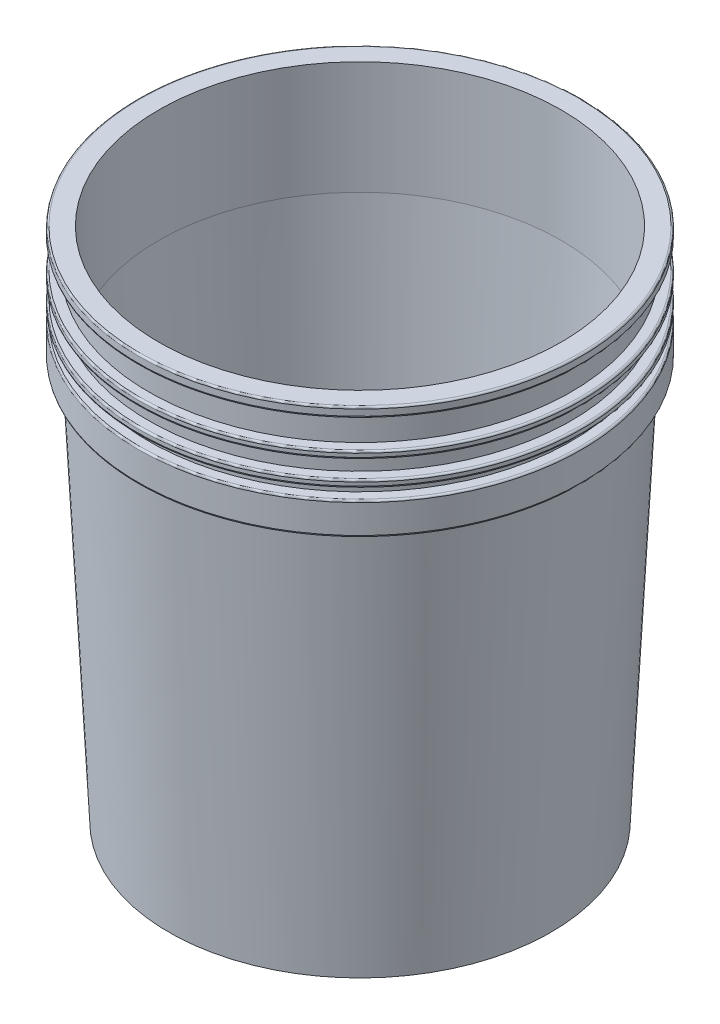
ISO-10303-21;
HEADER;
FILE_DESCRIPTION(('STEP AP214'),'2;1');
FILE_NAME('part.step','',(''),(''),'','','');
FILE_SCHEMA(('AUTOMOTIVE_DESIGN { 1 0 10303 214 1 1 1 1 }'));
ENDSEC;
DATA;
#1=APPLICATION_CONTEXT('core data for automotive mechanical design processes');
#2=APPLICATION_PROTOCOL_DEFINITION('international standard','automotive_design',2000,#1);
#3=PRODUCT_CONTEXT('',#1,'mechanical');
#4=PRODUCT('Part','Part','',(#3));
#5=PRODUCT_RELATED_PRODUCT_CATEGORY('part','',(#4));
#6=PRODUCT_DEFINITION_FORMATION('','',#4);
#7=PRODUCT_DEFINITION_CONTEXT('part definition',#1,'design');
#8=PRODUCT_DEFINITION('design','',#6,#7);
#9=PRODUCT_DEFINITION_SHAPE('','',#8);
#10=(LENGTH_UNIT() NAMED_UNIT(*) SI_UNIT(.MILLI.,.METRE.));
#11=(NAMED_UNIT(*) PLANE_ANGLE_UNIT() SI_UNIT($,.RADIAN.));
#12=(NAMED_UNIT(*) SI_UNIT($,.STERADIAN.) SOLID_ANGLE_UNIT());
#13=UNCERTAINTY_MEASURE_WITH_UNIT(LENGTH_MEASURE(1.E-05),#10,'distance_accuracy_value','');
#14=(GEOMETRIC_REPRESENTATION_CONTEXT(3) GLOBAL_UNCERTAINTY_ASSIGNED_CONTEXT((#13)) GLOBAL_UNIT_ASSIGNED_CONTEXT((#10,
#11,#12)) REPRESENTATION_CONTEXT('',''));
#15=CARTESIAN_POINT('',(0.,0.,0.));
#16=DIRECTION('',(0.,0.,1.));
#17=DIRECTION('',(1.,0.,0.));
#18=AXIS2_PLACEMENT_3D('',#15,#16,#17);
#19=CARTESIAN_POINT('',(0.,6.35,0.));
#20=DIRECTION('',(0.,-1.,0.));
#21=DIRECTION('',(0.,0.,-1.));
#22=AXIS2_PLACEMENT_3D('',#19,#20,#21);
#23=PLANE('',#22);
#24=CARTESIAN_POINT('',(0.,6.35,0.));
#25=DIRECTION('',(0.,-1.,0.));
#26=DIRECTION('',(0.,0.,-1.));
#27=AXIS2_PLACEMENT_3D('',#24,#25,#26);
#28=CIRCLE('',#27,25.4);
#29=CARTESIAN_POINT('',(0.,6.35,-25.4));
#30=VERTEX_POINT('',#29);
#31=EDGE_CURVE('E109',#30,#30,#28,.T.);
#32=ORIENTED_EDGE('',*,*,#31,.T.);
#33=EDGE_LOOP('',(#32));
#34=FACE_BOUND('',#33,.T.);
#35=ADVANCED_FACE('F37',(#34),#23,.T.);
#36=CARTESIAN_POINT('',(0.,0.,0.));
#37=DIRECTION('',(0.,-1.,0.));
#38=DIRECTION('',(0.,0.,-1.));
#39=AXIS2_PLACEMENT_3D('',#36,#37,#38);
#40=CYLINDRICAL_SURFACE('',#39,25.4);
#41=CARTESIAN_POINT('',(0.,0.,0.));
#42=DIRECTION('',(0.,-1.,0.));
#43=DIRECTION('',(0.,0.,-1.));
#44=AXIS2_PLACEMENT_3D('',#41,#42,#43);
#45=CIRCLE('',#44,25.4);
#46=CARTESIAN_POINT('',(0.,0.,-25.4));
#47=VERTEX_POINT('',#46);
#48=EDGE_CURVE('E113',#47,#47,#45,.T.);
#49=ORIENTED_EDGE('',*,*,#48,.T.);
#50=EDGE_LOOP('',(#49));
#51=FACE_BOUND('',#50,.T.);
#52=ORIENTED_EDGE('',*,*,#31,.F.);
#53=EDGE_LOOP('',(#52));
#54=FACE_BOUND('',#53,.T.);
#55=ADVANCED_FACE('F195',(#51,#54),#40,.F.);
#56=CARTESIAN_POINT('',(25.4,0.,0.));
#57=DIRECTION('',(0.,-1.,0.));
#58=DIRECTION('',(0.,0.,-1.));
#59=AXIS2_PLACEMENT_3D('',#56,#57,#58);
#60=PLANE('',#59);
#61=CARTESIAN_POINT('',(0.,0.,0.));
#62=DIRECTION('',(0.,-1.,0.));
#63=DIRECTION('',(0.,0.,-1.));
#64=AXIS2_PLACEMENT_3D('',#61,#62,#63);
#65=CIRCLE('',#64,32.4);
#66=CARTESIAN_POINT('',(0.,0.,-32.4));
#67=VERTEX_POINT('',#66);
#68=EDGE_CURVE('E117',#67,#67,#65,.T.);
#69=ORIENTED_EDGE('',*,*,#68,.T.);
#70=EDGE_LOOP('',(#69));
#71=FACE_BOUND('',#70,.T.);
#72=ORIENTED_EDGE('',*,*,#48,.F.);
#73=EDGE_LOOP('',(#72));
#74=FACE_BOUND('',#73,.T.);
#75=ADVANCED_FACE('F201',(#71,#74),#60,.T.);
#76=CARTESIAN_POINT('',(0.,0.,0.));
#77=DIRECTION('',(0.,-1.,0.));
#78=DIRECTION('',(0.,0.,-1.));
#79=AXIS2_PLACEMENT_3D('',#76,#77,#78);
#80=CYLINDRICAL_SURFACE('',#79,32.4);
#81=CARTESIAN_POINT('',(0.,6.35,0.));
#82=DIRECTION('',(0.,-1.,0.));
#83=DIRECTION('',(0.,0.,-1.));
#84=AXIS2_PLACEMENT_3D('',#81,#82,#83);
#85=CIRCLE('',#84,32.4);
#86=CARTESIAN_POINT('',(0.,6.35,-32.4));
#87=VERTEX_POINT('',#86);
#88=EDGE_CURVE('E121',#87,#87,#85,.T.);
#89=ORIENTED_EDGE('',*,*,#88,.T.);
#90=EDGE_LOOP('',(#89));
#91=FACE_BOUND('',#90,.T.);
#92=ORIENTED_EDGE('',*,*,#68,.F.);
#93=EDGE_LOOP('',(#92));
#94=FACE_BOUND('',#93,.T.);
#95=ADVANCED_FACE('F266',(#91,#94),#80,.T.);
#96=CARTESIAN_POINT('',(32.4,6.35,0.));
#97=DIRECTION('',(0.,-1.,0.));
#98=DIRECTION('',(0.,0.,-1.));
#99=AXIS2_PLACEMENT_3D('',#96,#97,#98);
#100=PLANE('',#99);
#101=CARTESIAN_POINT('',(0.,6.35,0.));
#102=DIRECTION('',(0.,-1.,0.));
#103=DIRECTION('',(0.,0.,-1.));
#104=AXIS2_PLACEMENT_3D('',#101,#102,#103);
#105=CIRCLE('',#104,129.664353062856);
#106=CARTESIAN_POINT('',(0.,6.35,-129.664353062856));
#107=VERTEX_POINT('',#106);
#108=EDGE_CURVE('E125',#107,#107,#105,.T.);
#109=ORIENTED_EDGE('',*,*,#108,.T.);
#110=EDGE_LOOP('',(#109));
#111=FACE_BOUND('',#110,.T.);
#112=ORIENTED_EDGE('',*,*,#88,.F.);
#113=EDGE_LOOP('',(#112));
#114=FACE_BOUND('',#113,.T.);
#115=ADVANCED_FACE('F262',(#111,#114),#100,.T.);
#116=CARTESIAN_POINT('',(0.,6.35,0.));
#117=DIRECTION('',(0.,1.,0.));
#118=DIRECTION('',(0.,0.,1.));
#119=AXIS2_PLACEMENT_3D('',#116,#117,#118);
#120=CONICAL_SURFACE('',#119,129.664353062856,0.0495425861086201);
#121=CARTESIAN_POINT('',(0.,0.,0.));
#122=DIRECTION('',(0.,-1.,0.));
#123=DIRECTION('',(0.,0.,-1.));
#124=AXIS2_PLACEMENT_3D('',#121,#122,#123);
#125=CIRCLE('',#124,129.3495);
#126=CARTESIAN_POINT('',(0.,0.,-129.3495));
#127=VERTEX_POINT('',#126);
#128=EDGE_CURVE('E129',#127,#127,#125,.T.);
#129=ORIENTED_EDGE('',*,*,#128,.T.);
#130=EDGE_LOOP('',(#129));
#131=FACE_BOUND('',#130,.T.);
#132=ORIENTED_EDGE('',*,*,#108,.F.);
#133=EDGE_LOOP('',(#132));
#134=FACE_BOUND('',#133,.T.);
#135=ADVANCED_FACE('F258',(#131,#134),#120,.F.);
#136=CARTESIAN_POINT('',(129.3495,0.,0.));
#137=DIRECTION('',(0.,-1.,0.));
#138=DIRECTION('',(0.,0.,-1.));
#139=AXIS2_PLACEMENT_3D('',#136,#137,#138);
#140=PLANE('',#139);
#141=CARTESIAN_POINT('',(0.,0.,0.));
#142=DIRECTION('',(0.,-1.,0.));
#143=DIRECTION('',(0.,0.,-1.));
#144=AXIS2_PLACEMENT_3D('',#141,#142,#143);
#145=CIRCLE('',#144,136.3495);
#146=CARTESIAN_POINT('',(0.,0.,-136.3495));
#147=VERTEX_POINT('',#146);
#148=EDGE_CURVE('E133',#147,#147,#145,.T.);
#149=ORIENTED_EDGE('',*,*,#148,.T.);
#150=EDGE_LOOP('',(#149));
#151=FACE_BOUND('',#150,.T.);
#152=ORIENTED_EDGE('',*,*,#128,.F.);
#153=EDGE_LOOP('',(#152));
#154=FACE_BOUND('',#153,.T.);
#155=ADVANCED_FACE('F254',(#151,#154),#140,.T.);
#156=CARTESIAN_POINT('',(0.,0.,0.));
#157=DIRECTION('',(0.,1.,0.));
#158=DIRECTION('',(0.,0.,1.));
#159=AXIS2_PLACEMENT_3D('',#156,#157,#158);
#160=CONICAL_SURFACE('',#159,136.3495,0.0495425861086222);
#161=CARTESIAN_POINT('',(0.,287.64,0.));
#162=DIRECTION('',(0.,-1.,0.));
#163=DIRECTION('',(0.,0.,-1.));
#164=AXIS2_PLACEMENT_3D('',#161,#162,#163);
#165=CIRCLE('',#164,150.6116);
#166=CARTESIAN_POINT('',(0.,287.64,-150.6116));
#167=VERTEX_POINT('',#166);
#168=EDGE_CURVE('E137',#167,#167,#165,.T.);
#169=ORIENTED_EDGE('',*,*,#168,.T.);
#170=EDGE_LOOP('',(#169));
#171=FACE_BOUND('',#170,.T.);
#172=ORIENTED_EDGE('',*,*,#148,.F.);
#173=EDGE_LOOP('',(#172));
#174=FACE_BOUND('',#173,.T.);
#175=ADVANCED_FACE('F248',(#171,#174),#160,.T.);
#176=CARTESIAN_POINT('',(158.2316,287.64,0.));
#177=DIRECTION('',(0.,-1.,0.));
#178=DIRECTION('',(0.,0.,-1.));
#179=AXIS2_PLACEMENT_3D('',#176,#177,#178);
#180=PLANE('',#179);
#181=CARTESIAN_POINT('',(0.,287.64,0.));
#182=DIRECTION('',(0.,-1.,0.));
#183=DIRECTION('',(0.,0.,-1.));
#184=AXIS2_PLACEMENT_3D('',#181,#182,#183);
#185=CIRCLE('',#184,156.9616);
#186=CARTESIAN_POINT('',(0.,287.64,-156.9616));
#187=VERTEX_POINT('',#186);
#188=EDGE_CURVE('E10',#187,#187,#185,.T.);
#189=ORIENTED_EDGE('',*,*,#188,.T.);
#190=EDGE_LOOP('',(#189));
#191=FACE_BOUND('',#190,.T.);
#192=ORIENTED_EDGE('',*,*,#168,.F.);
#193=EDGE_LOOP('',(#192));
#194=FACE_BOUND('',#193,.T.);
#195=ADVANCED_FACE('F238',(#191,#194),#180,.T.);
#196=CARTESIAN_POINT('',(0.,0.,0.));
#197=DIRECTION('',(0.,-1.,0.));
#198=DIRECTION('',(0.,0.,-1.));
#199=AXIS2_PLACEMENT_3D('',#196,#197,#198);
#200=CYLINDRICAL_SURFACE('',#199,158.2316);
#201=CARTESIAN_POINT('',(0.,309.23,0.));
#202=DIRECTION('',(0.,1.,0.));
#203=DIRECTION('',(0.,0.,1.));
#204=AXIS2_PLACEMENT_3D('',#201,#202,#203);
#205=CIRCLE('',#204,158.2316);
#206=CARTESIAN_POINT('',(0.,309.23,158.2316));
#207=VERTEX_POINT('',#206);
#208=EDGE_CURVE('E50',#207,#207,#205,.F.);
#209=ORIENTED_EDGE('',*,*,#208,.T.);
#210=EDGE_LOOP('',(#209));
#211=FACE_BOUND('',#210,.T.);
#212=CARTESIAN_POINT('',(0.,288.91,0.));
#213=DIRECTION('',(0.,-1.,0.));
#214=DIRECTION('',(0.,0.,-1.));
#215=AXIS2_PLACEMENT_3D('',#212,#213,#214);
#216=CIRCLE('',#215,158.2316);
#217=CARTESIAN_POINT('',(0.,288.91,-158.2316));
#218=VERTEX_POINT('',#217);
#219=EDGE_CURVE('E55',#218,#218,#216,.F.);
#220=ORIENTED_EDGE('',*,*,#219,.T.);
#221=EDGE_LOOP('',(#220));
#222=FACE_BOUND('',#221,.T.);
#223=ADVANCED_FACE('F234',(#211,#222),#200,.T.);
#224=CARTESIAN_POINT('',(150.6116,310.5,0.));
#225=DIRECTION('',(0.,1.,0.));
#226=DIRECTION('',(0.,0.,1.));
#227=AXIS2_PLACEMENT_3D('',#224,#225,#226);
#228=PLANE('',#227);
#229=CARTESIAN_POINT('',(0.,310.5,0.));
#230=DIRECTION('',(0.,1.,0.));
#231=DIRECTION('',(0.,0.,1.));
#232=AXIS2_PLACEMENT_3D('',#229,#230,#231);
#233=CIRCLE('',#232,156.9616);
#234=CARTESIAN_POINT('',(0.,310.5,156.9616));
#235=VERTEX_POINT('',#234);
#236=EDGE_CURVE('E45',#235,#235,#233,.T.);
#237=ORIENTED_EDGE('',*,*,#236,.T.);
#238=EDGE_LOOP('',(#237));
#239=FACE_BOUND('',#238,.T.);
#240=CARTESIAN_POINT('',(0.,310.5,0.));
#241=DIRECTION('',(0.,-1.,0.));
#242=DIRECTION('',(0.,0.,-1.));
#243=AXIS2_PLACEMENT_3D('',#240,#241,#242);
#244=CIRCLE('',#243,150.6116);
#245=CARTESIAN_POINT('',(0.,310.5,-150.6116));
#246=VERTEX_POINT('',#245);
#247=EDGE_CURVE('E141',#246,#246,#244,.T.);
#248=ORIENTED_EDGE('',*,*,#247,.T.);
#249=EDGE_LOOP('',(#248));
#250=FACE_BOUND('',#249,.T.);
#251=ADVANCED_FACE('F237',(#239,#250),#228,.T.);
#252=CARTESIAN_POINT('',(0.,0.,0.));
#253=DIRECTION('',(0.,-1.,0.));
#254=DIRECTION('',(0.,0.,-1.));
#255=AXIS2_PLACEMENT_3D('',#252,#253,#254);
#256=CYLINDRICAL_SURFACE('',#255,150.6116);
#257=CARTESIAN_POINT('',(0.,318.12,0.));
#258=DIRECTION('',(0.,-1.,0.));
#259=DIRECTION('',(0.,0.,-1.));
#260=AXIS2_PLACEMENT_3D('',#257,#258,#259);
#261=CIRCLE('',#260,150.6116);
#262=CARTESIAN_POINT('',(0.,318.12,-150.6116));
#263=VERTEX_POINT('',#262);
#264=EDGE_CURVE('E145',#263,#263,#261,.T.);
#265=ORIENTED_EDGE('',*,*,#264,.T.);
#266=EDGE_LOOP('',(#265));
#267=FACE_BOUND('',#266,.T.);
#268=ORIENTED_EDGE('',*,*,#247,.F.);
#269=EDGE_LOOP('',(#268));
#270=FACE_BOUND('',#269,.T.);
#271=ADVANCED_FACE('F246',(#267,#270),#256,.T.);
#272=CARTESIAN_POINT('',(158.2316,318.12,0.));
#273=DIRECTION('',(0.,-1.,0.));
#274=DIRECTION('',(0.,0.,-1.));
#275=AXIS2_PLACEMENT_3D('',#272,#273,#274);
#276=PLANE('',#275);
#277=CARTESIAN_POINT('',(0.,318.12,0.));
#278=DIRECTION('',(0.,-1.,0.));
#279=DIRECTION('',(0.,0.,-1.));
#280=AXIS2_PLACEMENT_3D('',#277,#278,#279);
#281=CIRCLE('',#280,156.9616);
#282=CARTESIAN_POINT('',(0.,318.12,-156.9616));
#283=VERTEX_POINT('',#282);
#284=EDGE_CURVE('E61',#283,#283,#281,.T.);
#285=ORIENTED_EDGE('',*,*,#284,.T.);
#286=EDGE_LOOP('',(#285));
#287=FACE_BOUND('',#286,.T.);
#288=ORIENTED_EDGE('',*,*,#264,.F.);
#289=EDGE_LOOP('',(#288));
#290=FACE_BOUND('',#289,.T.);
#291=ADVANCED_FACE('F327',(#287,#290),#276,.T.);
#292=CARTESIAN_POINT('',(0.,0.,0.));
#293=DIRECTION('',(0.,-1.,0.));
#294=DIRECTION('',(0.,0.,-1.));
#295=AXIS2_PLACEMENT_3D('',#292,#293,#294);
#296=CYLINDRICAL_SURFACE('',#295,158.2316);
#297=CARTESIAN_POINT('',(0.,321.93,0.));
#298=DIRECTION('',(0.,1.,0.));
#299=DIRECTION('',(0.,0.,1.));
#300=AXIS2_PLACEMENT_3D('',#297,#298,#299);
#301=CIRCLE('',#300,158.2316);
#302=CARTESIAN_POINT('',(0.,321.93,158.2316));
#303=VERTEX_POINT('',#302);
#304=EDGE_CURVE('E69',#303,#303,#301,.F.);
#305=ORIENTED_EDGE('',*,*,#304,.T.);
#306=EDGE_LOOP('',(#305));
#307=FACE_BOUND('',#306,.T.);
#308=CARTESIAN_POINT('',(0.,319.39,0.));
#309=DIRECTION('',(0.,-1.,0.));
#310=DIRECTION('',(0.,0.,-1.));
#311=AXIS2_PLACEMENT_3D('',#308,#309,#310);
#312=CIRCLE('',#311,158.2316);
#313=CARTESIAN_POINT('',(0.,319.39,-158.2316));
#314=VERTEX_POINT('',#313);
#315=EDGE_CURVE('E73',#314,#314,#312,.F.);
#316=ORIENTED_EDGE('',*,*,#315,.T.);
#317=EDGE_LOOP('',(#316));
#318=FACE_BOUND('',#317,.T.);
#319=ADVANCED_FACE('F332',(#307,#318),#296,.T.);
#320=CARTESIAN_POINT('',(150.6116,323.2,0.));
#321=DIRECTION('',(0.,1.,0.));
#322=DIRECTION('',(0.,0.,1.));
#323=AXIS2_PLACEMENT_3D('',#320,#321,#322);
#324=PLANE('',#323);
#325=CARTESIAN_POINT('',(0.,323.2,0.));
#326=DIRECTION('',(0.,1.,0.));
#327=DIRECTION('',(0.,0.,1.));
#328=AXIS2_PLACEMENT_3D('',#325,#326,#327);
#329=CIRCLE('',#328,156.9616);
#330=CARTESIAN_POINT('',(0.,323.2,156.9616));
#331=VERTEX_POINT('',#330);
#332=EDGE_CURVE('E65',#331,#331,#329,.T.);
#333=ORIENTED_EDGE('',*,*,#332,.T.);
#334=EDGE_LOOP('',(#333));
#335=FACE_BOUND('',#334,.T.);
#336=CARTESIAN_POINT('',(0.,323.2,0.));
#337=DIRECTION('',(0.,-1.,0.));
#338=DIRECTION('',(0.,0.,-1.));
#339=AXIS2_PLACEMENT_3D('',#336,#337,#338);
#340=CIRCLE('',#339,150.6116);
#341=CARTESIAN_POINT('',(0.,323.2,-150.6116));
#342=VERTEX_POINT('',#341);
#343=EDGE_CURVE('E149',#342,#342,#340,.T.);
#344=ORIENTED_EDGE('',*,*,#343,.T.);
#345=EDGE_LOOP('',(#344));
#346=FACE_BOUND('',#345,.T.);
#347=ADVANCED_FACE('F342',(#335,#346),#324,.T.);
#348=CARTESIAN_POINT('',(0.,0.,0.));
#349=DIRECTION('',(0.,-1.,0.));
#350=DIRECTION('',(0.,0.,-1.));
#351=AXIS2_PLACEMENT_3D('',#348,#349,#350);
#352=CYLINDRICAL_SURFACE('',#351,150.6116);
#353=CARTESIAN_POINT('',(0.,335.9,0.));
#354=DIRECTION('',(0.,-1.,0.));
#355=DIRECTION('',(0.,0.,-1.));
#356=AXIS2_PLACEMENT_3D('',#353,#354,#355);
#357=CIRCLE('',#356,150.6116);
#358=CARTESIAN_POINT('',(0.,335.9,-150.6116));
#359=VERTEX_POINT('',#358);
#360=EDGE_CURVE('E153',#359,#359,#357,.T.);
#361=ORIENTED_EDGE('',*,*,#360,.T.);
#362=EDGE_LOOP('',(#361));
#363=FACE_BOUND('',#362,.T.);
#364=ORIENTED_EDGE('',*,*,#343,.F.);
#365=EDGE_LOOP('',(#364));
#366=FACE_BOUND('',#365,.T.);
#367=ADVANCED_FACE('F352',(#363,#366),#352,.T.);
#368=CARTESIAN_POINT('',(158.2316,335.9,0.));
#369=DIRECTION('',(0.,-1.,0.));
#370=DIRECTION('',(0.,0.,-1.));
#371=AXIS2_PLACEMENT_3D('',#368,#369,#370);
#372=PLANE('',#371);
#373=CARTESIAN_POINT('',(0.,335.9,0.));
#374=DIRECTION('',(0.,-1.,0.));
#375=DIRECTION('',(0.,0.,-1.));
#376=AXIS2_PLACEMENT_3D('',#373,#374,#375);
#377=CIRCLE('',#376,156.9616);
#378=CARTESIAN_POINT('',(0.,335.9,-156.9616));
#379=VERTEX_POINT('',#378);
#380=EDGE_CURVE('E77',#379,#379,#377,.T.);
#381=ORIENTED_EDGE('',*,*,#380,.T.);
#382=EDGE_LOOP('',(#381));
#383=FACE_BOUND('',#382,.T.);
#384=ORIENTED_EDGE('',*,*,#360,.F.);
#385=EDGE_LOOP('',(#384));
#386=FACE_BOUND('',#385,.T.);
#387=ADVANCED_FACE('F360',(#383,#386),#372,.T.);
#388=CARTESIAN_POINT('',(0.,0.,0.));
#389=DIRECTION('',(0.,-1.,0.));
#390=DIRECTION('',(0.,0.,-1.));
#391=AXIS2_PLACEMENT_3D('',#388,#389,#390);
#392=CYLINDRICAL_SURFACE('',#391,158.2316);
#393=CARTESIAN_POINT('',(0.,339.71,0.));
#394=DIRECTION('',(0.,1.,0.));
#395=DIRECTION('',(0.,0.,1.));
#396=AXIS2_PLACEMENT_3D('',#393,#394,#395);
#397=CIRCLE('',#396,158.2316);
#398=CARTESIAN_POINT('',(0.,339.71,158.2316));
#399=VERTEX_POINT('',#398);
#400=EDGE_CURVE('E85',#399,#399,#397,.F.);
#401=ORIENTED_EDGE('',*,*,#400,.T.);
#402=EDGE_LOOP('',(#401));
#403=FACE_BOUND('',#402,.T.);
#404=CARTESIAN_POINT('',(0.,337.17,0.));
#405=DIRECTION('',(0.,-1.,0.));
#406=DIRECTION('',(0.,0.,-1.));
#407=AXIS2_PLACEMENT_3D('',#404,#405,#406);
#408=CIRCLE('',#407,158.2316);
#409=CARTESIAN_POINT('',(0.,337.17,-158.2316));
#410=VERTEX_POINT('',#409);
#411=EDGE_CURVE('E89',#410,#410,#408,.F.);
#412=ORIENTED_EDGE('',*,*,#411,.T.);
#413=EDGE_LOOP('',(#412));
#414=FACE_BOUND('',#413,.T.);
#415=ADVANCED_FACE('F365',(#403,#414),#392,.T.);
#416=CARTESIAN_POINT('',(150.6116,340.98,0.));
#417=DIRECTION('',(0.,1.,0.));
#418=DIRECTION('',(0.,0.,1.));
#419=AXIS2_PLACEMENT_3D('',#416,#417,#418);
#420=PLANE('',#419);
#421=CARTESIAN_POINT('',(0.,340.98,0.));
#422=DIRECTION('',(0.,1.,0.));
#423=DIRECTION('',(0.,0.,1.));
#424=AXIS2_PLACEMENT_3D('',#421,#422,#423);
#425=CIRCLE('',#424,156.9616);
#426=CARTESIAN_POINT('',(0.,340.98,156.9616));
#427=VERTEX_POINT('',#426);
#428=EDGE_CURVE('E81',#427,#427,#425,.T.);
#429=ORIENTED_EDGE('',*,*,#428,.T.);
#430=EDGE_LOOP('',(#429));
#431=FACE_BOUND('',#430,.T.);
#432=CARTESIAN_POINT('',(0.,340.98,0.));
#433=DIRECTION('',(0.,-1.,0.));
#434=DIRECTION('',(0.,0.,-1.));
#435=AXIS2_PLACEMENT_3D('',#432,#433,#434);
#436=CIRCLE('',#435,150.6116);
#437=CARTESIAN_POINT('',(0.,340.98,-150.6116));
#438=VERTEX_POINT('',#437);
#439=EDGE_CURVE('E157',#438,#438,#436,.T.);
#440=ORIENTED_EDGE('',*,*,#439,.T.);
#441=EDGE_LOOP('',(#440));
#442=FACE_BOUND('',#441,.T.);
#443=ADVANCED_FACE('F375',(#431,#442),#420,.T.);
#444=CARTESIAN_POINT('',(0.,0.,0.));
#445=DIRECTION('',(0.,-1.,0.));
#446=DIRECTION('',(0.,0.,-1.));
#447=AXIS2_PLACEMENT_3D('',#444,#445,#446);
#448=CYLINDRICAL_SURFACE('',#447,150.6116);
#449=CARTESIAN_POINT('',(0.,361.3,0.));
#450=DIRECTION('',(0.,-1.,0.));
#451=DIRECTION('',(0.,0.,-1.));
#452=AXIS2_PLACEMENT_3D('',#449,#450,#451);
#453=CIRCLE('',#452,150.6116);
#454=CARTESIAN_POINT('',(0.,361.3,-150.6116));
#455=VERTEX_POINT('',#454);
#456=EDGE_CURVE('E161',#455,#455,#453,.T.);
#457=ORIENTED_EDGE('',*,*,#456,.T.);
#458=EDGE_LOOP('',(#457));
#459=FACE_BOUND('',#458,.T.);
#460=ORIENTED_EDGE('',*,*,#439,.F.);
#461=EDGE_LOOP('',(#460));
#462=FACE_BOUND('',#461,.T.);
#463=ADVANCED_FACE('F385',(#459,#462),#448,.T.);
#464=CARTESIAN_POINT('',(158.2316,361.3,0.));
#465=DIRECTION('',(0.,-1.,0.));
#466=DIRECTION('',(0.,0.,-1.));
#467=AXIS2_PLACEMENT_3D('',#464,#465,#466);
#468=PLANE('',#467);
#469=CARTESIAN_POINT('',(0.,361.3,0.));
#470=DIRECTION('',(0.,-1.,0.));
#471=DIRECTION('',(0.,0.,-1.));
#472=AXIS2_PLACEMENT_3D('',#469,#470,#471);
#473=CIRCLE('',#472,156.9616);
#474=CARTESIAN_POINT('',(0.,361.3,-156.9616));
#475=VERTEX_POINT('',#474);
#476=EDGE_CURVE('E93',#475,#475,#473,.T.);
#477=ORIENTED_EDGE('',*,*,#476,.T.);
#478=EDGE_LOOP('',(#477));
#479=FACE_BOUND('',#478,.T.);
#480=ORIENTED_EDGE('',*,*,#456,.F.);
#481=EDGE_LOOP('',(#480));
#482=FACE_BOUND('',#481,.T.);
#483=ADVANCED_FACE('F393',(#479,#482),#468,.T.);
#484=CARTESIAN_POINT('',(0.,0.,0.));
#485=DIRECTION('',(0.,-1.,0.));
#486=DIRECTION('',(0.,0.,-1.));
#487=AXIS2_PLACEMENT_3D('',#484,#485,#486);
#488=CYLINDRICAL_SURFACE('',#487,158.2316);
#489=CARTESIAN_POINT('',(0.,367.03,0.));
#490=DIRECTION('',(0.,1.,0.));
#491=DIRECTION('',(0.,0.,1.));
#492=AXIS2_PLACEMENT_3D('',#489,#490,#491);
#493=CIRCLE('',#492,158.2316);
#494=CARTESIAN_POINT('',(0.,367.03,158.2316));
#495=VERTEX_POINT('',#494);
#496=EDGE_CURVE('E101',#495,#495,#493,.F.);
#497=ORIENTED_EDGE('',*,*,#496,.T.);
#498=EDGE_LOOP('',(#497));
#499=FACE_BOUND('',#498,.T.);
#500=CARTESIAN_POINT('',(0.,362.57,0.));
#501=DIRECTION('',(0.,-1.,0.));
#502=DIRECTION('',(0.,0.,-1.));
#503=AXIS2_PLACEMENT_3D('',#500,#501,#502);
#504=CIRCLE('',#503,158.2316);
#505=CARTESIAN_POINT('',(0.,362.57,-158.2316));
#506=VERTEX_POINT('',#505);
#507=EDGE_CURVE('E105',#506,#506,#504,.F.);
#508=ORIENTED_EDGE('',*,*,#507,.T.);
#509=EDGE_LOOP('',(#508));
#510=FACE_BOUND('',#509,.T.);
#511=ADVANCED_FACE('F398',(#499,#510),#488,.T.);
#512=CARTESIAN_POINT('',(143.6116,368.3,0.));
#513=DIRECTION('',(0.,1.,0.));
#514=DIRECTION('',(0.,0.,1.));
#515=AXIS2_PLACEMENT_3D('',#512,#513,#514);
#516=PLANE('',#515);
#517=CARTESIAN_POINT('',(0.,368.3,0.));
#518=DIRECTION('',(0.,1.,0.));
#519=DIRECTION('',(0.,0.,1.));
#520=AXIS2_PLACEMENT_3D('',#517,#518,#519);
#521=CIRCLE('',#520,156.9616);
#522=CARTESIAN_POINT('',(0.,368.3,156.9616));
#523=VERTEX_POINT('',#522);
#524=EDGE_CURVE('E97',#523,#523,#521,.T.);
#525=ORIENTED_EDGE('',*,*,#524,.T.);
#526=EDGE_LOOP('',(#525));
#527=FACE_BOUND('',#526,.T.);
#528=CARTESIAN_POINT('',(0.,368.3,0.));
#529=DIRECTION('',(0.,-1.,0.));
#530=DIRECTION('',(0.,0.,-1.));
#531=AXIS2_PLACEMENT_3D('',#528,#529,#530);
#532=CIRCLE('',#531,143.6116);
#533=CARTESIAN_POINT('',(0.,368.3,-143.6116));
#534=VERTEX_POINT('',#533);
#535=EDGE_CURVE('E165',#534,#534,#532,.T.);
#536=ORIENTED_EDGE('',*,*,#535,.T.);
#537=EDGE_LOOP('',(#536));
#538=FACE_BOUND('',#537,.T.);
#539=ADVANCED_FACE('F408',(#527,#538),#516,.T.);
#540=CARTESIAN_POINT('',(0.,0.,0.));
#541=DIRECTION('',(0.,-1.,0.));
#542=DIRECTION('',(0.,0.,-1.));
#543=AXIS2_PLACEMENT_3D('',#540,#541,#542);
#544=CYLINDRICAL_SURFACE('',#543,143.6116);
#545=CARTESIAN_POINT('',(0.,287.64,0.));
#546=DIRECTION('',(0.,-1.,0.));
#547=DIRECTION('',(0.,0.,-1.));
#548=AXIS2_PLACEMENT_3D('',#545,#546,#547);
#549=CIRCLE('',#548,143.6116);
#550=CARTESIAN_POINT('',(0.,287.64,-143.6116));
#551=VERTEX_POINT('',#550);
#552=EDGE_CURVE('E169',#551,#551,#549,.T.);
#553=ORIENTED_EDGE('',*,*,#552,.T.);
#554=EDGE_LOOP('',(#553));
#555=FACE_BOUND('',#554,.T.);
#556=ORIENTED_EDGE('',*,*,#535,.F.);
#557=EDGE_LOOP('',(#556));
#558=FACE_BOUND('',#557,.T.);
#559=ADVANCED_FACE('F192',(#555,#558),#544,.F.);
#560=CARTESIAN_POINT('',(0.,287.64,0.));
#561=DIRECTION('',(0.,1.,0.));
#562=DIRECTION('',(0.,0.,1.));
#563=AXIS2_PLACEMENT_3D('',#560,#561,#562);
#564=CONICAL_SURFACE('',#563,143.6116,0.0495425861086222);
#565=CARTESIAN_POINT('',(0.,13.35,0.));
#566=DIRECTION('',(0.,-1.,0.));
#567=DIRECTION('',(0.,0.,-1.));
#568=AXIS2_PLACEMENT_3D('',#565,#566,#567);
#569=CIRCLE('',#568,130.011435179391);
#570=CARTESIAN_POINT('',(0.,13.35,-130.011435179391));
#571=VERTEX_POINT('',#570);
#572=EDGE_CURVE('E173',#571,#571,#569,.T.);
#573=ORIENTED_EDGE('',*,*,#572,.T.);
#574=EDGE_LOOP('',(#573));
#575=FACE_BOUND('',#574,.T.);
#576=ORIENTED_EDGE('',*,*,#552,.F.);
#577=EDGE_LOOP('',(#576));
#578=FACE_BOUND('',#577,.T.);
#579=ADVANCED_FACE('F178',(#575,#578),#564,.F.);
#580=CARTESIAN_POINT('',(130.011435179391,13.35,0.));
#581=DIRECTION('',(0.,1.,0.));
#582=DIRECTION('',(0.,0.,1.));
#583=AXIS2_PLACEMENT_3D('',#580,#581,#582);
#584=PLANE('',#583);
#585=ORIENTED_EDGE('',*,*,#572,.F.);
#586=EDGE_LOOP('',(#585));
#587=FACE_BOUND('',#586,.T.);
#588=ADVANCED_FACE('F181',(#587),#584,.T.);
#589=CARTESIAN_POINT('',(0.,367.03,0.));
#590=DIRECTION('',(0.,1.,0.));
#591=DIRECTION('',(0.,0.,1.));
#592=AXIS2_PLACEMENT_3D('',#589,#590,#591);
#593=TOROIDAL_SURFACE('',#592,156.9616,1.27);
#594=ORIENTED_EDGE('',*,*,#524,.F.);
#595=EDGE_LOOP('',(#594));
#596=FACE_BOUND('',#595,.T.);
#597=ORIENTED_EDGE('',*,*,#496,.F.);
#598=EDGE_LOOP('',(#597));
#599=FACE_BOUND('',#598,.T.);
#600=ADVANCED_FACE('F183',(#596,#599),#593,.T.);
#601=CARTESIAN_POINT('',(0.,362.57,0.));
#602=DIRECTION('',(0.,-1.,0.));
#603=DIRECTION('',(0.,0.,-1.));
#604=AXIS2_PLACEMENT_3D('',#601,#602,#603);
#605=TOROIDAL_SURFACE('',#604,156.9616,1.27);
#606=ORIENTED_EDGE('',*,*,#507,.F.);
#607=EDGE_LOOP('',(#606));
#608=FACE_BOUND('',#607,.T.);
#609=ORIENTED_EDGE('',*,*,#476,.F.);
#610=EDGE_LOOP('',(#609));
#611=FACE_BOUND('',#610,.T.);
#612=ADVANCED_FACE('F189',(#608,#611),#605,.T.);
#613=CARTESIAN_POINT('',(0.,339.71,0.));
#614=DIRECTION('',(0.,1.,0.));
#615=DIRECTION('',(0.,0.,1.));
#616=AXIS2_PLACEMENT_3D('',#613,#614,#615);
#617=TOROIDAL_SURFACE('',#616,156.9616,1.27);
#618=ORIENTED_EDGE('',*,*,#428,.F.);
#619=EDGE_LOOP('',(#618));
#620=FACE_BOUND('',#619,.T.);
#621=ORIENTED_EDGE('',*,*,#400,.F.);
#622=EDGE_LOOP('',(#621));
#623=FACE_BOUND('',#622,.T.);
#624=ADVANCED_FACE('F208',(#620,#623),#617,.T.);
#625=CARTESIAN_POINT('',(0.,337.17,0.));
#626=DIRECTION('',(0.,-1.,0.));
#627=DIRECTION('',(0.,0.,-1.));
#628=AXIS2_PLACEMENT_3D('',#625,#626,#627);
#629=TOROIDAL_SURFACE('',#628,156.9616,1.27);
#630=ORIENTED_EDGE('',*,*,#411,.F.);
#631=EDGE_LOOP('',(#630));
#632=FACE_BOUND('',#631,.T.);
#633=ORIENTED_EDGE('',*,*,#380,.F.);
#634=EDGE_LOOP('',(#633));
#635=FACE_BOUND('',#634,.T.);
#636=ADVANCED_FACE('F212',(#632,#635),#629,.T.);
#637=CARTESIAN_POINT('',(0.,321.93,0.));
#638=DIRECTION('',(0.,1.,0.));
#639=DIRECTION('',(0.,0.,1.));
#640=AXIS2_PLACEMENT_3D('',#637,#638,#639);
#641=TOROIDAL_SURFACE('',#640,156.9616,1.27);
#642=ORIENTED_EDGE('',*,*,#332,.F.);
#643=EDGE_LOOP('',(#642));
#644=FACE_BOUND('',#643,.T.);
#645=ORIENTED_EDGE('',*,*,#304,.F.);
#646=EDGE_LOOP('',(#645));
#647=FACE_BOUND('',#646,.T.);
#648=ADVANCED_FACE('F216',(#644,#647),#641,.T.);
#649=CARTESIAN_POINT('',(0.,319.39,0.));
#650=DIRECTION('',(0.,-1.,0.));
#651=DIRECTION('',(0.,0.,-1.));
#652=AXIS2_PLACEMENT_3D('',#649,#650,#651);
#653=TOROIDAL_SURFACE('',#652,156.9616,1.27);
#654=ORIENTED_EDGE('',*,*,#315,.F.);
#655=EDGE_LOOP('',(#654));
#656=FACE_BOUND('',#655,.T.);
#657=ORIENTED_EDGE('',*,*,#284,.F.);
#658=EDGE_LOOP('',(#657));
#659=FACE_BOUND('',#658,.T.);
#660=ADVANCED_FACE('F220',(#656,#659),#653,.T.);
#661=CARTESIAN_POINT('',(0.,309.23,0.));
#662=DIRECTION('',(0.,1.,0.));
#663=DIRECTION('',(0.,0.,1.));
#664=AXIS2_PLACEMENT_3D('',#661,#662,#663);
#665=TOROIDAL_SURFACE('',#664,156.9616,1.27);
#666=ORIENTED_EDGE('',*,*,#236,.F.);
#667=EDGE_LOOP('',(#666));
#668=FACE_BOUND('',#667,.T.);
#669=ORIENTED_EDGE('',*,*,#208,.F.);
#670=EDGE_LOOP('',(#669));
#671=FACE_BOUND('',#670,.T.);
#672=ADVANCED_FACE('F223',(#668,#671),#665,.T.);
#673=CARTESIAN_POINT('',(0.,288.91,0.));
#674=DIRECTION('',(0.,-1.,0.));
#675=DIRECTION('',(0.,0.,-1.));
#676=AXIS2_PLACEMENT_3D('',#673,#674,#675);
#677=TOROIDAL_SURFACE('',#676,156.9616,1.27);
#678=ORIENTED_EDGE('',*,*,#219,.F.);
#679=EDGE_LOOP('',(#678));
#680=FACE_BOUND('',#679,.T.);
#681=ORIENTED_EDGE('',*,*,#188,.F.);
#682=EDGE_LOOP('',(#681));
#683=FACE_BOUND('',#682,.T.);
#684=ADVANCED_FACE('F39',(#680,#683),#677,.T.);
#685=CLOSED_SHELL('',(#35,#55,#75,#95,#115,#135,#155,#175,#195,#223,#251,#271,#291,#319,#347,
#367,#387,#415,#443,#463,#483,#511,#539,#559,#579,#588,#600,#612,#624,#636,#648,#660,#672,#684));
#686=MANIFOLD_SOLID_BREP('B2',#685);
#687=ADVANCED_BREP_SHAPE_REPRESENTATION('',(#18,#686),#14);
#688=SHAPE_DEFINITION_REPRESENTATION(#9,#687);
ENDSEC;
END-ISO-10303-21;
